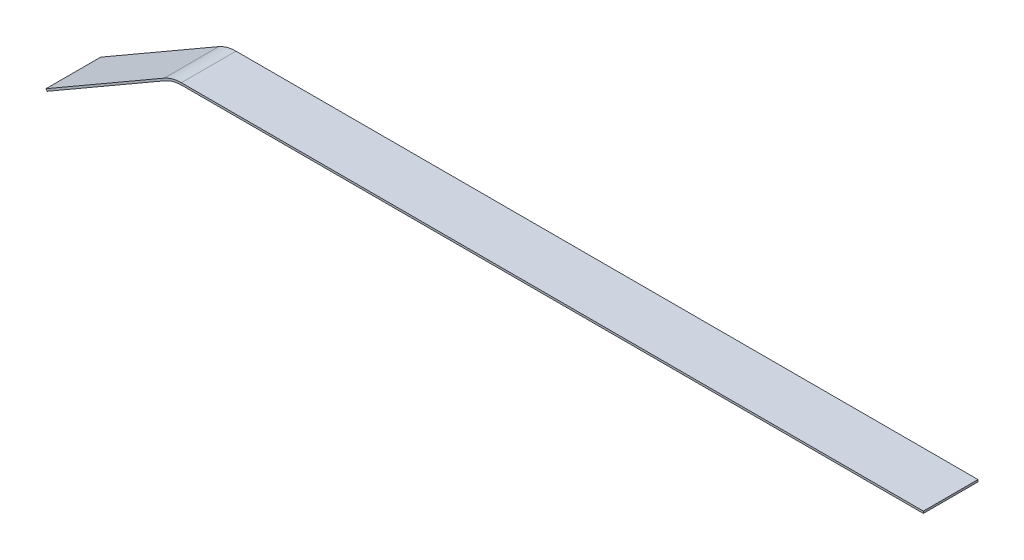
ISO-10303-21;
HEADER;
FILE_DESCRIPTION(('STEP AP214'),'2;1');
FILE_NAME('part.step','',(''),(''),'','','');
FILE_SCHEMA(('AUTOMOTIVE_DESIGN { 1 0 10303 214 1 1 1 1 }'));
ENDSEC;
DATA;
#1=APPLICATION_CONTEXT('core data for automotive mechanical design processes');
#2=APPLICATION_PROTOCOL_DEFINITION('international standard','automotive_design',2000,#1);
#3=PRODUCT_CONTEXT('',#1,'mechanical');
#4=PRODUCT('Part','Part','',(#3));
#5=PRODUCT_RELATED_PRODUCT_CATEGORY('part','',(#4));
#6=PRODUCT_DEFINITION_FORMATION('','',#4);
#7=PRODUCT_DEFINITION_CONTEXT('part definition',#1,'design');
#8=PRODUCT_DEFINITION('design','',#6,#7);
#9=PRODUCT_DEFINITION_SHAPE('','',#8);
#10=(LENGTH_UNIT() NAMED_UNIT(*) SI_UNIT(.MILLI.,.METRE.));
#11=(NAMED_UNIT(*) PLANE_ANGLE_UNIT() SI_UNIT($,.RADIAN.));
#12=(NAMED_UNIT(*) SI_UNIT($,.STERADIAN.) SOLID_ANGLE_UNIT());
#13=UNCERTAINTY_MEASURE_WITH_UNIT(LENGTH_MEASURE(1.E-05),#10,'distance_accuracy_value','');
#14=(GEOMETRIC_REPRESENTATION_CONTEXT(3) GLOBAL_UNCERTAINTY_ASSIGNED_CONTEXT((#13)) GLOBAL_UNIT_ASSIGNED_CONTEXT((#10,
#11,#12)) REPRESENTATION_CONTEXT('',''));
#15=CARTESIAN_POINT('',(0.,0.,0.));
#16=DIRECTION('',(0.,0.,1.));
#17=DIRECTION('',(1.,0.,0.));
#18=AXIS2_PLACEMENT_3D('',#15,#16,#17);
#19=CARTESIAN_POINT('',(-1283.30762113533,-109.296806022132,80.));
#20=DIRECTION('',(0.866025403784442,0.499999999999994,0.));
#21=DIRECTION('',(-0.499999999999994,0.866025403784442,0.));
#22=AXIS2_PLACEMENT_3D('',#19,#20,#21);
#23=PLANE('',#22);
#24=DIRECTION('',(0.499999999999994,-0.866025403784442,0.));
#25=VECTOR('',#24,1.);
#26=CARTESIAN_POINT('',(-1283.30762113533,-109.296806022132,0.));
#27=LINE('',#26,#25);
#28=CARTESIAN_POINT('',(-1284.80762113533,-106.698729810778,0.));
#29=VERTEX_POINT('',#28);
#30=CARTESIAN_POINT('',(-1283.30762113533,-109.296806022132,0.));
#31=VERTEX_POINT('',#30);
#32=EDGE_CURVE('E131',#29,#31,#27,.T.);
#33=ORIENTED_EDGE('',*,*,#32,.T.);
#34=DIRECTION('',(0.,0.,-1.));
#35=VECTOR('',#34,1.);
#36=CARTESIAN_POINT('',(-1283.30762113533,-109.296806022132,80.));
#37=LINE('',#36,#35);
#38=CARTESIAN_POINT('',(-1283.30762113533,-109.296806022132,80.));
#39=VERTEX_POINT('',#38);
#40=EDGE_CURVE('E11',#39,#31,#37,.T.);
#41=ORIENTED_EDGE('',*,*,#40,.F.);
#42=DIRECTION('',(0.499999999999994,-0.866025403784442,0.));
#43=VECTOR('',#42,1.);
#44=CARTESIAN_POINT('',(-1283.30762113533,-109.296806022132,80.));
#45=LINE('',#44,#43);
#46=CARTESIAN_POINT('',(-1284.80762113533,-106.698729810778,80.));
#47=VERTEX_POINT('',#46);
#48=EDGE_CURVE('E145',#47,#39,#45,.T.);
#49=ORIENTED_EDGE('',*,*,#48,.F.);
#50=DIRECTION('',(0.,0.,-1.));
#51=VECTOR('',#50,1.);
#52=CARTESIAN_POINT('',(-1284.80762113533,-106.698729810778,80.));
#53=LINE('',#52,#51);
#54=EDGE_CURVE('E127',#47,#29,#53,.T.);
#55=ORIENTED_EDGE('',*,*,#54,.T.);
#56=EDGE_LOOP('',(#33,#41,#49,#55));
#57=FACE_BOUND('',#56,.T.);
#58=ADVANCED_FACE('F35',(#57),#23,.F.);
#59=CARTESIAN_POINT('',(-1110.79869280115,-9.69872981077825,80.));
#60=DIRECTION('',(-0.500000000000002,0.866025403784438,0.));
#61=DIRECTION('',(-0.866025403784438,-0.500000000000002,0.));
#62=AXIS2_PLACEMENT_3D('',#59,#60,#61);
#63=PLANE('',#62);
#64=DIRECTION('',(0.866025403784438,0.500000000000002,0.));
#65=VECTOR('',#64,1.);
#66=CARTESIAN_POINT('',(-1110.79869280115,-9.69872981077825,0.));
#67=LINE('',#66,#65);
#68=CARTESIAN_POINT('',(-1110.79869280115,-9.69872981077826,0.));
#69=VERTEX_POINT('',#68);
#70=EDGE_CURVE('E134',#31,#69,#67,.T.);
#71=ORIENTED_EDGE('',*,*,#70,.T.);
#72=DIRECTION('',(0.,0.,-1.));
#73=VECTOR('',#72,1.);
#74=CARTESIAN_POINT('',(-1110.79869280115,-9.69872981077826,80.));
#75=LINE('',#74,#73);
#76=CARTESIAN_POINT('',(-1110.79869280115,-9.69872981077826,80.));
#77=VERTEX_POINT('',#76);
#78=EDGE_CURVE('E43',#77,#69,#75,.T.);
#79=ORIENTED_EDGE('',*,*,#78,.F.);
#80=DIRECTION('',(0.866025403784438,0.500000000000002,0.));
#81=VECTOR('',#80,1.);
#82=CARTESIAN_POINT('',(-1110.79869280115,-9.69872981077825,80.));
#83=LINE('',#82,#81);
#84=EDGE_CURVE('E94',#39,#77,#83,.T.);
#85=ORIENTED_EDGE('',*,*,#84,.F.);
#86=ORIENTED_EDGE('',*,*,#40,.T.);
#87=EDGE_LOOP('',(#71,#79,#85,#86));
#88=FACE_BOUND('',#87,.T.);
#89=ADVANCED_FACE('F180',(#88),#63,.F.);
#90=CARTESIAN_POINT('',(-1085.79869280115,-53.0000000000001,80.));
#91=DIRECTION('',(0.,0.,-1.));
#92=DIRECTION('',(-1.,0.,0.));
#93=AXIS2_PLACEMENT_3D('',#90,#91,#92);
#94=CYLINDRICAL_SURFACE('',#93,50.);
#95=CARTESIAN_POINT('',(-1085.79869280115,-53.0000000000001,0.));
#96=DIRECTION('',(0.,0.,-1.));
#97=DIRECTION('',(-1.,0.,0.));
#98=AXIS2_PLACEMENT_3D('',#95,#96,#97);
#99=CIRCLE('',#98,50.);
#100=CARTESIAN_POINT('',(-1085.79869280115,-3.00000000000013,0.));
#101=VERTEX_POINT('',#100);
#102=EDGE_CURVE('E136',#69,#101,#99,.T.);
#103=ORIENTED_EDGE('',*,*,#102,.T.);
#104=DIRECTION('',(0.,0.,-1.));
#105=VECTOR('',#104,1.);
#106=CARTESIAN_POINT('',(-1085.79869280115,-3.00000000000013,80.));
#107=LINE('',#106,#105);
#108=CARTESIAN_POINT('',(-1085.79869280115,-3.00000000000013,80.));
#109=VERTEX_POINT('',#108);
#110=EDGE_CURVE('E152',#109,#101,#107,.T.);
#111=ORIENTED_EDGE('',*,*,#110,.F.);
#112=CARTESIAN_POINT('',(-1085.79869280115,-53.0000000000001,80.));
#113=DIRECTION('',(0.,0.,-1.));
#114=DIRECTION('',(-1.,0.,0.));
#115=AXIS2_PLACEMENT_3D('',#112,#113,#114);
#116=CIRCLE('',#115,50.);
#117=EDGE_CURVE('E160',#77,#109,#116,.T.);
#118=ORIENTED_EDGE('',*,*,#117,.F.);
#119=ORIENTED_EDGE('',*,*,#78,.T.);
#120=EDGE_LOOP('',(#103,#111,#118,#119));
#121=FACE_BOUND('',#120,.T.);
#122=ADVANCED_FACE('F158',(#121),#94,.F.);
#123=CARTESIAN_POINT('',(0.,-3.,80.));
#124=DIRECTION('',(0.,1.,0.));
#125=DIRECTION('',(-1.,0.,0.));
#126=AXIS2_PLACEMENT_3D('',#123,#124,#125);
#127=PLANE('',#126);
#128=DIRECTION('',(1.,0.,0.));
#129=VECTOR('',#128,1.);
#130=CARTESIAN_POINT('',(0.,-3.,0.));
#131=LINE('',#130,#129);
#132=CARTESIAN_POINT('',(0.,-3.,0.));
#133=VERTEX_POINT('',#132);
#134=EDGE_CURVE('E138',#101,#133,#131,.T.);
#135=ORIENTED_EDGE('',*,*,#134,.T.);
#136=DIRECTION('',(0.,0.,-1.));
#137=VECTOR('',#136,1.);
#138=CARTESIAN_POINT('',(0.,-3.,80.));
#139=LINE('',#138,#137);
#140=CARTESIAN_POINT('',(0.,-3.,80.));
#141=VERTEX_POINT('',#140);
#142=EDGE_CURVE('E149',#141,#133,#139,.T.);
#143=ORIENTED_EDGE('',*,*,#142,.F.);
#144=DIRECTION('',(1.,0.,0.));
#145=VECTOR('',#144,1.);
#146=CARTESIAN_POINT('',(0.,-3.,80.));
#147=LINE('',#146,#145);
#148=EDGE_CURVE('E172',#109,#141,#147,.T.);
#149=ORIENTED_EDGE('',*,*,#148,.F.);
#150=ORIENTED_EDGE('',*,*,#110,.T.);
#151=EDGE_LOOP('',(#135,#143,#149,#150));
#152=FACE_BOUND('',#151,.T.);
#153=ADVANCED_FACE('F168',(#152),#127,.F.);
#154=CARTESIAN_POINT('',(0.,0.,80.));
#155=DIRECTION('',(-1.,0.,0.));
#156=DIRECTION('',(0.,-1.,0.));
#157=AXIS2_PLACEMENT_3D('',#154,#155,#156);
#158=PLANE('',#157);
#159=DIRECTION('',(0.,1.,0.));
#160=VECTOR('',#159,1.);
#161=CARTESIAN_POINT('',(0.,0.,0.));
#162=LINE('',#161,#160);
#163=CARTESIAN_POINT('',(0.,0.,0.));
#164=VERTEX_POINT('',#163);
#165=EDGE_CURVE('E140',#133,#164,#162,.T.);
#166=ORIENTED_EDGE('',*,*,#165,.T.);
#167=DIRECTION('',(0.,0.,-1.));
#168=VECTOR('',#167,1.);
#169=CARTESIAN_POINT('',(0.,0.,80.));
#170=LINE('',#169,#168);
#171=CARTESIAN_POINT('',(0.,0.,80.));
#172=VERTEX_POINT('',#171);
#173=EDGE_CURVE('E122',#172,#164,#170,.T.);
#174=ORIENTED_EDGE('',*,*,#173,.F.);
#175=DIRECTION('',(0.,1.,0.));
#176=VECTOR('',#175,1.);
#177=CARTESIAN_POINT('',(0.,0.,80.));
#178=LINE('',#177,#176);
#179=EDGE_CURVE('E113',#141,#172,#178,.T.);
#180=ORIENTED_EDGE('',*,*,#179,.F.);
#181=ORIENTED_EDGE('',*,*,#142,.T.);
#182=EDGE_LOOP('',(#166,#174,#180,#181));
#183=FACE_BOUND('',#182,.T.);
#184=ADVANCED_FACE('F171',(#183),#158,.F.);
#185=CARTESIAN_POINT('',(-1086.60254037844,0.,80.));
#186=DIRECTION('',(0.,-1.,0.));
#187=DIRECTION('',(0.,0.,-1.));
#188=AXIS2_PLACEMENT_3D('',#185,#186,#187);
#189=PLANE('',#188);
#190=DIRECTION('',(-1.,0.,0.));
#191=VECTOR('',#190,1.);
#192=CARTESIAN_POINT('',(-1086.60254037844,0.,0.));
#193=LINE('',#192,#191);
#194=CARTESIAN_POINT('',(-1086.60254037844,0.,0.));
#195=VERTEX_POINT('',#194);
#196=EDGE_CURVE('E121',#164,#195,#193,.T.);
#197=ORIENTED_EDGE('',*,*,#196,.T.);
#198=DIRECTION('',(0.,0.,-1.));
#199=VECTOR('',#198,1.);
#200=CARTESIAN_POINT('',(-1086.60254037844,0.,80.));
#201=LINE('',#200,#199);
#202=CARTESIAN_POINT('',(-1086.60254037844,0.,80.));
#203=VERTEX_POINT('',#202);
#204=EDGE_CURVE('E118',#203,#195,#201,.T.);
#205=ORIENTED_EDGE('',*,*,#204,.F.);
#206=DIRECTION('',(-1.,0.,0.));
#207=VECTOR('',#206,1.);
#208=CARTESIAN_POINT('',(-1086.60254037844,0.,80.));
#209=LINE('',#208,#207);
#210=EDGE_CURVE('E107',#172,#203,#209,.T.);
#211=ORIENTED_EDGE('',*,*,#210,.F.);
#212=ORIENTED_EDGE('',*,*,#173,.T.);
#213=EDGE_LOOP('',(#197,#205,#211,#212));
#214=FACE_BOUND('',#213,.T.);
#215=ADVANCED_FACE('F119',(#214),#189,.F.);
#216=CARTESIAN_POINT('',(-1086.60254037844,-50.,80.));
#217=DIRECTION('',(0.,0.,-1.));
#218=DIRECTION('',(-1.,0.,0.));
#219=AXIS2_PLACEMENT_3D('',#216,#217,#218);
#220=CYLINDRICAL_SURFACE('',#219,50.);
#221=CARTESIAN_POINT('',(-1086.60254037844,-50.,0.));
#222=DIRECTION('',(0.,0.,1.));
#223=DIRECTION('',(-1.,0.,0.));
#224=AXIS2_PLACEMENT_3D('',#221,#222,#223);
#225=CIRCLE('',#224,50.);
#226=CARTESIAN_POINT('',(-1111.60254037844,-6.69872981077805,0.));
#227=VERTEX_POINT('',#226);
#228=EDGE_CURVE('E80',#195,#227,#225,.T.);
#229=ORIENTED_EDGE('',*,*,#228,.T.);
#230=DIRECTION('',(0.,0.,-1.));
#231=VECTOR('',#230,1.);
#232=CARTESIAN_POINT('',(-1111.60254037844,-6.69872981077805,80.));
#233=LINE('',#232,#231);
#234=CARTESIAN_POINT('',(-1111.60254037844,-6.69872981077805,80.));
#235=VERTEX_POINT('',#234);
#236=EDGE_CURVE('E123',#235,#227,#233,.T.);
#237=ORIENTED_EDGE('',*,*,#236,.F.);
#238=CARTESIAN_POINT('',(-1086.60254037844,-50.,80.));
#239=DIRECTION('',(0.,0.,1.));
#240=DIRECTION('',(-1.,0.,0.));
#241=AXIS2_PLACEMENT_3D('',#238,#239,#240);
#242=CIRCLE('',#241,50.);
#243=EDGE_CURVE('E111',#203,#235,#242,.T.);
#244=ORIENTED_EDGE('',*,*,#243,.F.);
#245=ORIENTED_EDGE('',*,*,#204,.T.);
#246=EDGE_LOOP('',(#229,#237,#244,#245));
#247=FACE_BOUND('',#246,.T.);
#248=ADVANCED_FACE('F125',(#247),#220,.T.);
#249=CARTESIAN_POINT('',(-1284.80762113533,-106.698729810778,80.));
#250=DIRECTION('',(0.500000000000001,-0.866025403784438,0.));
#251=DIRECTION('',(0.866025403784438,0.500000000000001,0.));
#252=AXIS2_PLACEMENT_3D('',#249,#250,#251);
#253=PLANE('',#252);
#254=DIRECTION('',(-0.866025403784438,-0.500000000000001,0.));
#255=VECTOR('',#254,1.);
#256=CARTESIAN_POINT('',(-1284.80762113533,-106.698729810778,0.));
#257=LINE('',#256,#255);
#258=EDGE_CURVE('E86',#227,#29,#257,.T.);
#259=ORIENTED_EDGE('',*,*,#258,.T.);
#260=ORIENTED_EDGE('',*,*,#54,.F.);
#261=DIRECTION('',(-0.866025403784438,-0.500000000000001,0.));
#262=VECTOR('',#261,1.);
#263=CARTESIAN_POINT('',(-1284.80762113533,-106.698729810778,80.));
#264=LINE('',#263,#262);
#265=EDGE_CURVE('E51',#235,#47,#264,.T.);
#266=ORIENTED_EDGE('',*,*,#265,.F.);
#267=ORIENTED_EDGE('',*,*,#236,.T.);
#268=EDGE_LOOP('',(#259,#260,#266,#267));
#269=FACE_BOUND('',#268,.T.);
#270=ADVANCED_FACE('F196',(#269),#253,.F.);
#271=CARTESIAN_POINT('',(-1086.60254037844,-50.,80.));
#272=DIRECTION('',(0.,0.,-1.));
#273=DIRECTION('',(-1.,0.,0.));
#274=AXIS2_PLACEMENT_3D('',#271,#272,#273);
#275=PLANE('',#274);
#276=ORIENTED_EDGE('',*,*,#48,.T.);
#277=ORIENTED_EDGE('',*,*,#84,.T.);
#278=ORIENTED_EDGE('',*,*,#117,.T.);
#279=ORIENTED_EDGE('',*,*,#148,.T.);
#280=ORIENTED_EDGE('',*,*,#179,.T.);
#281=ORIENTED_EDGE('',*,*,#210,.T.);
#282=ORIENTED_EDGE('',*,*,#243,.T.);
#283=ORIENTED_EDGE('',*,*,#265,.T.);
#284=EDGE_LOOP('',(#276,#277,#278,#279,#280,#281,#282,#283));
#285=FACE_BOUND('',#284,.T.);
#286=ADVANCED_FACE('F109',(#285),#275,.F.);
#287=CARTESIAN_POINT('',(-1086.60254037844,-50.,0.));
#288=DIRECTION('',(0.,0.,-1.));
#289=DIRECTION('',(-1.,0.,0.));
#290=AXIS2_PLACEMENT_3D('',#287,#288,#289);
#291=PLANE('',#290);
#292=ORIENTED_EDGE('',*,*,#32,.F.);
#293=ORIENTED_EDGE('',*,*,#258,.F.);
#294=ORIENTED_EDGE('',*,*,#228,.F.);
#295=ORIENTED_EDGE('',*,*,#196,.F.);
#296=ORIENTED_EDGE('',*,*,#165,.F.);
#297=ORIENTED_EDGE('',*,*,#134,.F.);
#298=ORIENTED_EDGE('',*,*,#102,.F.);
#299=ORIENTED_EDGE('',*,*,#70,.F.);
#300=EDGE_LOOP('',(#292,#293,#294,#295,#296,#297,#298,#299));
#301=FACE_BOUND('',#300,.T.);
#302=ADVANCED_FACE('F164',(#301),#291,.T.);
#303=CLOSED_SHELL('',(#58,#89,#122,#153,#184,#215,#248,#270,#286,#302));
#304=MANIFOLD_SOLID_BREP('B2',#303);
#305=ADVANCED_BREP_SHAPE_REPRESENTATION('',(#18,#304),#14);
#306=SHAPE_DEFINITION_REPRESENTATION(#9,#305);
ENDSEC;
END-ISO-10303-21;
